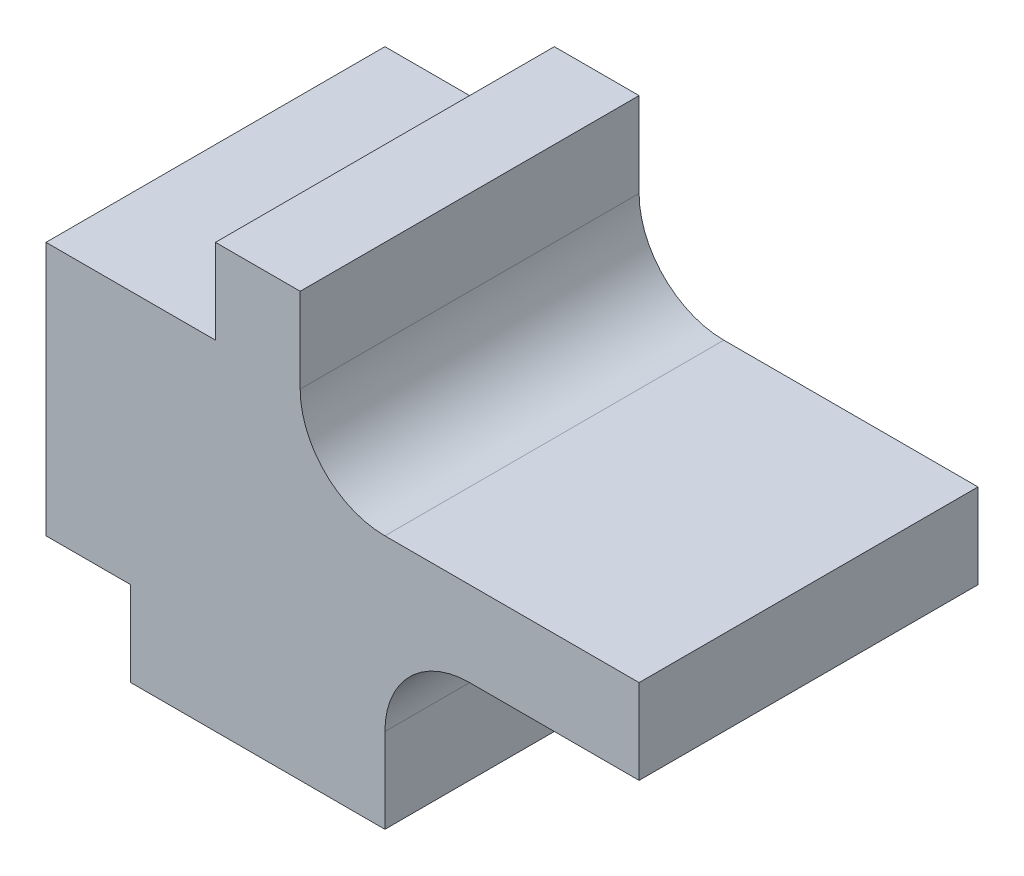
ISO-10303-21;
HEADER;
FILE_DESCRIPTION(('STEP AP214'),'2;1');
FILE_NAME('part.step','',(''),(''),'','','');
FILE_SCHEMA(('AUTOMOTIVE_DESIGN { 1 0 10303 214 1 1 1 1 }'));
ENDSEC;
DATA;
#1=APPLICATION_CONTEXT('core data for automotive mechanical design processes');
#2=APPLICATION_PROTOCOL_DEFINITION('international standard','automotive_design',2000,#1);
#3=PRODUCT_CONTEXT('',#1,'mechanical');
#4=PRODUCT('Part','Part','',(#3));
#5=PRODUCT_RELATED_PRODUCT_CATEGORY('part','',(#4));
#6=PRODUCT_DEFINITION_FORMATION('','',#4);
#7=PRODUCT_DEFINITION_CONTEXT('part definition',#1,'design');
#8=PRODUCT_DEFINITION('design','',#6,#7);
#9=PRODUCT_DEFINITION_SHAPE('','',#8);
#10=(LENGTH_UNIT() NAMED_UNIT(*) SI_UNIT(.MILLI.,.METRE.));
#11=(NAMED_UNIT(*) PLANE_ANGLE_UNIT() SI_UNIT($,.RADIAN.));
#12=(NAMED_UNIT(*) SI_UNIT($,.STERADIAN.) SOLID_ANGLE_UNIT());
#13=UNCERTAINTY_MEASURE_WITH_UNIT(LENGTH_MEASURE(1.E-05),#10,'distance_accuracy_value','');
#14=(GEOMETRIC_REPRESENTATION_CONTEXT(3) GLOBAL_UNCERTAINTY_ASSIGNED_CONTEXT((#13)) GLOBAL_UNIT_ASSIGNED_CONTEXT((#10,
#11,#12)) REPRESENTATION_CONTEXT('',''));
#15=CARTESIAN_POINT('',(0.,0.,0.));
#16=DIRECTION('',(0.,0.,1.));
#17=DIRECTION('',(1.,0.,0.));
#18=AXIS2_PLACEMENT_3D('',#15,#16,#17);
#19=CARTESIAN_POINT('',(0.,5.,20.));
#20=DIRECTION('',(1.,0.,0.));
#21=DIRECTION('',(0.,0.,-1.));
#22=AXIS2_PLACEMENT_3D('',#19,#20,#21);
#23=PLANE('',#22);
#24=DIRECTION('',(0.,-1.,0.));
#25=VECTOR('',#24,1.);
#26=CARTESIAN_POINT('',(0.,5.,0.));
#27=LINE('',#26,#25);
#28=CARTESIAN_POINT('',(0.,5.,0.));
#29=VERTEX_POINT('',#28);
#30=CARTESIAN_POINT('',(0.,0.,0.));
#31=VERTEX_POINT('',#30);
#32=EDGE_CURVE('E165',#29,#31,#27,.T.);
#33=ORIENTED_EDGE('',*,*,#32,.T.);
#34=DIRECTION('',(0.,0.,-1.));
#35=VECTOR('',#34,1.);
#36=CARTESIAN_POINT('',(0.,0.,20.));
#37=LINE('',#36,#35);
#38=CARTESIAN_POINT('',(0.,0.,20.));
#39=VERTEX_POINT('',#38);
#40=EDGE_CURVE('E11',#39,#31,#37,.T.);
#41=ORIENTED_EDGE('',*,*,#40,.F.);
#42=DIRECTION('',(0.,-1.,0.));
#43=VECTOR('',#42,1.);
#44=CARTESIAN_POINT('',(0.,5.,20.));
#45=LINE('',#44,#43);
#46=CARTESIAN_POINT('',(0.,5.,20.));
#47=VERTEX_POINT('',#46);
#48=EDGE_CURVE('E191',#47,#39,#45,.T.);
#49=ORIENTED_EDGE('',*,*,#48,.F.);
#50=DIRECTION('',(0.,0.,-1.));
#51=VECTOR('',#50,1.);
#52=CARTESIAN_POINT('',(0.,5.,20.));
#53=LINE('',#52,#51);
#54=EDGE_CURVE('E161',#47,#29,#53,.T.);
#55=ORIENTED_EDGE('',*,*,#54,.T.);
#56=EDGE_LOOP('',(#33,#41,#49,#55));
#57=FACE_BOUND('',#56,.T.);
#58=ADVANCED_FACE('F33',(#57),#23,.F.);
#59=CARTESIAN_POINT('',(0.,0.,20.));
#60=DIRECTION('',(0.,1.,0.));
#61=DIRECTION('',(0.,0.,1.));
#62=AXIS2_PLACEMENT_3D('',#59,#60,#61);
#63=PLANE('',#62);
#64=DIRECTION('',(1.,0.,0.));
#65=VECTOR('',#64,1.);
#66=CARTESIAN_POINT('',(0.,0.,0.));
#67=LINE('',#66,#65);
#68=CARTESIAN_POINT('',(15.,0.,0.));
#69=VERTEX_POINT('',#68);
#70=EDGE_CURVE('E168',#31,#69,#67,.T.);
#71=ORIENTED_EDGE('',*,*,#70,.T.);
#72=DIRECTION('',(0.,0.,-1.));
#73=VECTOR('',#72,1.);
#74=CARTESIAN_POINT('',(15.,0.,20.));
#75=LINE('',#74,#73);
#76=CARTESIAN_POINT('',(15.,0.,20.));
#77=VERTEX_POINT('',#76);
#78=EDGE_CURVE('E41',#77,#69,#75,.T.);
#79=ORIENTED_EDGE('',*,*,#78,.F.);
#80=DIRECTION('',(1.,0.,0.));
#81=VECTOR('',#80,1.);
#82=CARTESIAN_POINT('',(0.,0.,20.));
#83=LINE('',#82,#81);
#84=EDGE_CURVE('E110',#39,#77,#83,.T.);
#85=ORIENTED_EDGE('',*,*,#84,.F.);
#86=ORIENTED_EDGE('',*,*,#40,.T.);
#87=EDGE_LOOP('',(#71,#79,#85,#86));
#88=FACE_BOUND('',#87,.T.);
#89=ADVANCED_FACE('F279',(#88),#63,.F.);
#90=CARTESIAN_POINT('',(15.,0.,20.));
#91=DIRECTION('',(-1.,0.,0.));
#92=DIRECTION('',(0.,0.,1.));
#93=AXIS2_PLACEMENT_3D('',#90,#91,#92);
#94=PLANE('',#93);
#95=DIRECTION('',(0.,1.,0.));
#96=VECTOR('',#95,1.);
#97=CARTESIAN_POINT('',(15.,0.,0.));
#98=LINE('',#97,#96);
#99=CARTESIAN_POINT('',(15.,4.99999999999997,0.));
#100=VERTEX_POINT('',#99);
#101=EDGE_CURVE('E170',#69,#100,#98,.T.);
#102=ORIENTED_EDGE('',*,*,#101,.T.);
#103=DIRECTION('',(0.,0.,-1.));
#104=VECTOR('',#103,1.);
#105=CARTESIAN_POINT('',(15.,4.99999999999997,20.));
#106=LINE('',#105,#104);
#107=CARTESIAN_POINT('',(15.,4.99999999999997,20.));
#108=VERTEX_POINT('',#107);
#109=EDGE_CURVE('E216',#108,#100,#106,.T.);
#110=ORIENTED_EDGE('',*,*,#109,.F.);
#111=DIRECTION('',(0.,1.,0.));
#112=VECTOR('',#111,1.);
#113=CARTESIAN_POINT('',(15.,0.,20.));
#114=LINE('',#113,#112);
#115=EDGE_CURVE('E224',#77,#108,#114,.T.);
#116=ORIENTED_EDGE('',*,*,#115,.F.);
#117=ORIENTED_EDGE('',*,*,#78,.T.);
#118=EDGE_LOOP('',(#102,#110,#116,#117));
#119=FACE_BOUND('',#118,.T.);
#120=ADVANCED_FACE('F222',(#119),#94,.F.);
#121=CARTESIAN_POINT('',(20.,5.,20.));
#122=DIRECTION('',(0.,0.,-1.));
#123=DIRECTION('',(-1.,0.,0.));
#124=AXIS2_PLACEMENT_3D('',#121,#122,#123);
#125=CYLINDRICAL_SURFACE('',#124,5.);
#126=CARTESIAN_POINT('',(20.,5.,0.));
#127=DIRECTION('',(0.,0.,-1.));
#128=DIRECTION('',(-1.,0.,0.));
#129=AXIS2_PLACEMENT_3D('',#126,#127,#128);
#130=CIRCLE('',#129,5.);
#131=CARTESIAN_POINT('',(20.,10.,0.));
#132=VERTEX_POINT('',#131);
#133=EDGE_CURVE('E172',#100,#132,#130,.T.);
#134=ORIENTED_EDGE('',*,*,#133,.T.);
#135=DIRECTION('',(0.,0.,-1.));
#136=VECTOR('',#135,1.);
#137=CARTESIAN_POINT('',(20.,10.,20.));
#138=LINE('',#137,#136);
#139=CARTESIAN_POINT('',(20.,10.,20.));
#140=VERTEX_POINT('',#139);
#141=EDGE_CURVE('E213',#140,#132,#138,.T.);
#142=ORIENTED_EDGE('',*,*,#141,.F.);
#143=CARTESIAN_POINT('',(20.,5.,20.));
#144=DIRECTION('',(0.,0.,-1.));
#145=DIRECTION('',(-1.,0.,0.));
#146=AXIS2_PLACEMENT_3D('',#143,#144,#145);
#147=CIRCLE('',#146,5.);
#148=EDGE_CURVE('E242',#108,#140,#147,.T.);
#149=ORIENTED_EDGE('',*,*,#148,.F.);
#150=ORIENTED_EDGE('',*,*,#109,.T.);
#151=EDGE_LOOP('',(#134,#142,#149,#150));
#152=FACE_BOUND('',#151,.T.);
#153=ADVANCED_FACE('F233',(#152),#125,.F.);
#154=CARTESIAN_POINT('',(20.,10.,20.));
#155=DIRECTION('',(0.,1.,0.));
#156=DIRECTION('',(-1.,0.,0.));
#157=AXIS2_PLACEMENT_3D('',#154,#155,#156);
#158=PLANE('',#157);
#159=DIRECTION('',(1.,0.,0.));
#160=VECTOR('',#159,1.);
#161=CARTESIAN_POINT('',(20.,10.,0.));
#162=LINE('',#161,#160);
#163=CARTESIAN_POINT('',(30.,10.,0.));
#164=VERTEX_POINT('',#163);
#165=EDGE_CURVE('E174',#132,#164,#162,.T.);
#166=ORIENTED_EDGE('',*,*,#165,.T.);
#167=DIRECTION('',(0.,0.,-1.));
#168=VECTOR('',#167,1.);
#169=CARTESIAN_POINT('',(30.,10.,20.));
#170=LINE('',#169,#168);
#171=CARTESIAN_POINT('',(30.,10.,20.));
#172=VERTEX_POINT('',#171);
#173=EDGE_CURVE('E210',#172,#164,#170,.T.);
#174=ORIENTED_EDGE('',*,*,#173,.F.);
#175=DIRECTION('',(1.,0.,0.));
#176=VECTOR('',#175,1.);
#177=CARTESIAN_POINT('',(20.,10.,20.));
#178=LINE('',#177,#176);
#179=EDGE_CURVE('E239',#140,#172,#178,.T.);
#180=ORIENTED_EDGE('',*,*,#179,.F.);
#181=ORIENTED_EDGE('',*,*,#141,.T.);
#182=EDGE_LOOP('',(#166,#174,#180,#181));
#183=FACE_BOUND('',#182,.T.);
#184=ADVANCED_FACE('F237',(#183),#158,.F.);
#185=CARTESIAN_POINT('',(30.,10.,20.));
#186=DIRECTION('',(-1.,0.,0.));
#187=DIRECTION('',(0.,-1.,0.));
#188=AXIS2_PLACEMENT_3D('',#185,#186,#187);
#189=PLANE('',#188);
#190=DIRECTION('',(0.,1.,0.));
#191=VECTOR('',#190,1.);
#192=CARTESIAN_POINT('',(30.,10.,0.));
#193=LINE('',#192,#191);
#194=CARTESIAN_POINT('',(30.,15.,0.));
#195=VERTEX_POINT('',#194);
#196=EDGE_CURVE('E176',#164,#195,#193,.T.);
#197=ORIENTED_EDGE('',*,*,#196,.T.);
#198=DIRECTION('',(0.,0.,-1.));
#199=VECTOR('',#198,1.);
#200=CARTESIAN_POINT('',(30.,15.,20.));
#201=LINE('',#200,#199);
#202=CARTESIAN_POINT('',(30.,15.,20.));
#203=VERTEX_POINT('',#202);
#204=EDGE_CURVE('E207',#203,#195,#201,.T.);
#205=ORIENTED_EDGE('',*,*,#204,.F.);
#206=DIRECTION('',(0.,1.,0.));
#207=VECTOR('',#206,1.);
#208=CARTESIAN_POINT('',(30.,10.,20.));
#209=LINE('',#208,#207);
#210=EDGE_CURVE('E241',#172,#203,#209,.T.);
#211=ORIENTED_EDGE('',*,*,#210,.F.);
#212=ORIENTED_EDGE('',*,*,#173,.T.);
#213=EDGE_LOOP('',(#197,#205,#211,#212));
#214=FACE_BOUND('',#213,.T.);
#215=ADVANCED_FACE('F292',(#214),#189,.F.);
#216=CARTESIAN_POINT('',(30.,15.,20.));
#217=DIRECTION('',(0.,-1.,0.));
#218=DIRECTION('',(1.,0.,0.));
#219=AXIS2_PLACEMENT_3D('',#216,#217,#218);
#220=PLANE('',#219);
#221=DIRECTION('',(-1.,0.,0.));
#222=VECTOR('',#221,1.);
#223=CARTESIAN_POINT('',(30.,15.,0.));
#224=LINE('',#223,#222);
#225=CARTESIAN_POINT('',(15.,15.,0.));
#226=VERTEX_POINT('',#225);
#227=EDGE_CURVE('E178',#195,#226,#224,.T.);
#228=ORIENTED_EDGE('',*,*,#227,.T.);
#229=DIRECTION('',(0.,0.,-1.));
#230=VECTOR('',#229,1.);
#231=CARTESIAN_POINT('',(15.,15.,20.));
#232=LINE('',#231,#230);
#233=CARTESIAN_POINT('',(15.,15.,20.));
#234=VERTEX_POINT('',#233);
#235=EDGE_CURVE('E204',#234,#226,#232,.T.);
#236=ORIENTED_EDGE('',*,*,#235,.F.);
#237=DIRECTION('',(-1.,0.,0.));
#238=VECTOR('',#237,1.);
#239=CARTESIAN_POINT('',(30.,15.,20.));
#240=LINE('',#239,#238);
#241=EDGE_CURVE('E244',#203,#234,#240,.T.);
#242=ORIENTED_EDGE('',*,*,#241,.F.);
#243=ORIENTED_EDGE('',*,*,#204,.T.);
#244=EDGE_LOOP('',(#228,#236,#242,#243));
#245=FACE_BOUND('',#244,.T.);
#246=ADVANCED_FACE('F295',(#245),#220,.F.);
#247=CARTESIAN_POINT('',(15.,20.,20.));
#248=DIRECTION('',(0.,0.,-1.));
#249=DIRECTION('',(-1.,0.,0.));
#250=AXIS2_PLACEMENT_3D('',#247,#248,#249);
#251=CYLINDRICAL_SURFACE('',#250,5.);
#252=CARTESIAN_POINT('',(15.,20.,0.));
#253=DIRECTION('',(0.,0.,-1.));
#254=DIRECTION('',(-1.,0.,0.));
#255=AXIS2_PLACEMENT_3D('',#252,#253,#254);
#256=CIRCLE('',#255,5.);
#257=CARTESIAN_POINT('',(9.99999999999999,20.,0.));
#258=VERTEX_POINT('',#257);
#259=EDGE_CURVE('E180',#226,#258,#256,.T.);
#260=ORIENTED_EDGE('',*,*,#259,.T.);
#261=DIRECTION('',(0.,0.,-1.));
#262=VECTOR('',#261,1.);
#263=CARTESIAN_POINT('',(9.99999999999999,20.,20.));
#264=LINE('',#263,#262);
#265=CARTESIAN_POINT('',(9.99999999999999,20.,20.));
#266=VERTEX_POINT('',#265);
#267=EDGE_CURVE('E201',#266,#258,#264,.T.);
#268=ORIENTED_EDGE('',*,*,#267,.F.);
#269=CARTESIAN_POINT('',(15.,20.,20.));
#270=DIRECTION('',(0.,0.,-1.));
#271=DIRECTION('',(-1.,0.,0.));
#272=AXIS2_PLACEMENT_3D('',#269,#270,#271);
#273=CIRCLE('',#272,5.);
#274=EDGE_CURVE('E250',#234,#266,#273,.T.);
#275=ORIENTED_EDGE('',*,*,#274,.F.);
#276=ORIENTED_EDGE('',*,*,#235,.T.);
#277=EDGE_LOOP('',(#260,#268,#275,#276));
#278=FACE_BOUND('',#277,.T.);
#279=ADVANCED_FACE('F299',(#278),#251,.F.);
#280=CARTESIAN_POINT('',(9.99999999999999,20.,20.));
#281=DIRECTION('',(-1.,0.,0.));
#282=DIRECTION('',(0.,0.,1.));
#283=AXIS2_PLACEMENT_3D('',#280,#281,#282);
#284=PLANE('',#283);
#285=DIRECTION('',(0.,1.,0.));
#286=VECTOR('',#285,1.);
#287=CARTESIAN_POINT('',(9.99999999999999,20.,0.));
#288=LINE('',#287,#286);
#289=CARTESIAN_POINT('',(9.99999999999999,25.,0.));
#290=VERTEX_POINT('',#289);
#291=EDGE_CURVE('E182',#258,#290,#288,.T.);
#292=ORIENTED_EDGE('',*,*,#291,.T.);
#293=DIRECTION('',(0.,0.,-1.));
#294=VECTOR('',#293,1.);
#295=CARTESIAN_POINT('',(9.99999999999999,25.,20.));
#296=LINE('',#295,#294);
#297=CARTESIAN_POINT('',(9.99999999999999,25.,20.));
#298=VERTEX_POINT('',#297);
#299=EDGE_CURVE('E198',#298,#290,#296,.T.);
#300=ORIENTED_EDGE('',*,*,#299,.F.);
#301=DIRECTION('',(0.,1.,0.));
#302=VECTOR('',#301,1.);
#303=CARTESIAN_POINT('',(9.99999999999999,20.,20.));
#304=LINE('',#303,#302);
#305=EDGE_CURVE('E252',#266,#298,#304,.T.);
#306=ORIENTED_EDGE('',*,*,#305,.F.);
#307=ORIENTED_EDGE('',*,*,#267,.T.);
#308=EDGE_LOOP('',(#292,#300,#306,#307));
#309=FACE_BOUND('',#308,.T.);
#310=ADVANCED_FACE('F303',(#309),#284,.F.);
#311=CARTESIAN_POINT('',(9.99999999999999,25.,20.));
#312=DIRECTION('',(0.,-1.,0.));
#313=DIRECTION('',(1.,0.,0.));
#314=AXIS2_PLACEMENT_3D('',#311,#312,#313);
#315=PLANE('',#314);
#316=DIRECTION('',(-1.,0.,0.));
#317=VECTOR('',#316,1.);
#318=CARTESIAN_POINT('',(9.99999999999999,25.,0.));
#319=LINE('',#318,#317);
#320=CARTESIAN_POINT('',(4.99999999999999,25.,0.));
#321=VERTEX_POINT('',#320);
#322=EDGE_CURVE('E184',#290,#321,#319,.T.);
#323=ORIENTED_EDGE('',*,*,#322,.T.);
#324=DIRECTION('',(0.,0.,-1.));
#325=VECTOR('',#324,1.);
#326=CARTESIAN_POINT('',(4.99999999999999,25.,20.));
#327=LINE('',#326,#325);
#328=CARTESIAN_POINT('',(4.99999999999999,25.,20.));
#329=VERTEX_POINT('',#328);
#330=EDGE_CURVE('E195',#329,#321,#327,.T.);
#331=ORIENTED_EDGE('',*,*,#330,.F.);
#332=DIRECTION('',(-1.,0.,0.));
#333=VECTOR('',#332,1.);
#334=CARTESIAN_POINT('',(9.99999999999999,25.,20.));
#335=LINE('',#334,#333);
#336=EDGE_CURVE('E254',#298,#329,#335,.T.);
#337=ORIENTED_EDGE('',*,*,#336,.F.);
#338=ORIENTED_EDGE('',*,*,#299,.T.);
#339=EDGE_LOOP('',(#323,#331,#337,#338));
#340=FACE_BOUND('',#339,.T.);
#341=ADVANCED_FACE('F260',(#340),#315,.F.);
#342=CARTESIAN_POINT('',(4.99999999999999,25.,20.));
#343=DIRECTION('',(1.,0.,0.));
#344=DIRECTION('',(0.,1.,0.));
#345=AXIS2_PLACEMENT_3D('',#342,#343,#344);
#346=PLANE('',#345);
#347=DIRECTION('',(0.,-1.,0.));
#348=VECTOR('',#347,1.);
#349=CARTESIAN_POINT('',(4.99999999999999,25.,0.));
#350=LINE('',#349,#348);
#351=CARTESIAN_POINT('',(5.,20.,0.));
#352=VERTEX_POINT('',#351);
#353=EDGE_CURVE('E186',#321,#352,#350,.T.);
#354=ORIENTED_EDGE('',*,*,#353,.T.);
#355=DIRECTION('',(0.,0.,-1.));
#356=VECTOR('',#355,1.);
#357=CARTESIAN_POINT('',(5.,20.,20.));
#358=LINE('',#357,#356);
#359=CARTESIAN_POINT('',(5.,20.,20.));
#360=VERTEX_POINT('',#359);
#361=EDGE_CURVE('E156',#360,#352,#358,.T.);
#362=ORIENTED_EDGE('',*,*,#361,.F.);
#363=DIRECTION('',(0.,-1.,0.));
#364=VECTOR('',#363,1.);
#365=CARTESIAN_POINT('',(4.99999999999999,25.,20.));
#366=LINE('',#365,#364);
#367=EDGE_CURVE('E147',#329,#360,#366,.T.);
#368=ORIENTED_EDGE('',*,*,#367,.F.);
#369=ORIENTED_EDGE('',*,*,#330,.T.);
#370=EDGE_LOOP('',(#354,#362,#368,#369));
#371=FACE_BOUND('',#370,.T.);
#372=ADVANCED_FACE('F264',(#371),#346,.F.);
#373=CARTESIAN_POINT('',(5.,20.,20.));
#374=DIRECTION('',(0.,-1.,0.));
#375=DIRECTION('',(0.,0.,-1.));
#376=AXIS2_PLACEMENT_3D('',#373,#374,#375);
#377=PLANE('',#376);
#378=DIRECTION('',(-1.,0.,0.));
#379=VECTOR('',#378,1.);
#380=CARTESIAN_POINT('',(5.,20.,0.));
#381=LINE('',#380,#379);
#382=CARTESIAN_POINT('',(-5.,20.,0.));
#383=VERTEX_POINT('',#382);
#384=EDGE_CURVE('E155',#352,#383,#381,.T.);
#385=ORIENTED_EDGE('',*,*,#384,.T.);
#386=DIRECTION('',(0.,0.,-1.));
#387=VECTOR('',#386,1.);
#388=CARTESIAN_POINT('',(-5.,20.,20.));
#389=LINE('',#388,#387);
#390=CARTESIAN_POINT('',(-5.,20.,20.));
#391=VERTEX_POINT('',#390);
#392=EDGE_CURVE('E152',#391,#383,#389,.T.);
#393=ORIENTED_EDGE('',*,*,#392,.F.);
#394=DIRECTION('',(-1.,0.,0.));
#395=VECTOR('',#394,1.);
#396=CARTESIAN_POINT('',(5.,20.,20.));
#397=LINE('',#396,#395);
#398=EDGE_CURVE('E141',#360,#391,#397,.T.);
#399=ORIENTED_EDGE('',*,*,#398,.F.);
#400=ORIENTED_EDGE('',*,*,#361,.T.);
#401=EDGE_LOOP('',(#385,#393,#399,#400));
#402=FACE_BOUND('',#401,.T.);
#403=ADVANCED_FACE('F153',(#402),#377,.F.);
#404=CARTESIAN_POINT('',(-5.,20.,20.));
#405=DIRECTION('',(1.,0.,0.));
#406=DIRECTION('',(0.,1.,0.));
#407=AXIS2_PLACEMENT_3D('',#404,#405,#406);
#408=PLANE('',#407);
#409=DIRECTION('',(0.,-1.,0.));
#410=VECTOR('',#409,1.);
#411=CARTESIAN_POINT('',(-5.,20.,0.));
#412=LINE('',#411,#410);
#413=CARTESIAN_POINT('',(-5.,5.,0.));
#414=VERTEX_POINT('',#413);
#415=EDGE_CURVE('E96',#383,#414,#412,.T.);
#416=ORIENTED_EDGE('',*,*,#415,.T.);
#417=DIRECTION('',(0.,0.,-1.));
#418=VECTOR('',#417,1.);
#419=CARTESIAN_POINT('',(-5.,5.,20.));
#420=LINE('',#419,#418);
#421=CARTESIAN_POINT('',(-5.,5.,20.));
#422=VERTEX_POINT('',#421);
#423=EDGE_CURVE('E157',#422,#414,#420,.T.);
#424=ORIENTED_EDGE('',*,*,#423,.F.);
#425=DIRECTION('',(0.,-1.,0.));
#426=VECTOR('',#425,1.);
#427=CARTESIAN_POINT('',(-5.,20.,20.));
#428=LINE('',#427,#426);
#429=EDGE_CURVE('E145',#391,#422,#428,.T.);
#430=ORIENTED_EDGE('',*,*,#429,.F.);
#431=ORIENTED_EDGE('',*,*,#392,.T.);
#432=EDGE_LOOP('',(#416,#424,#430,#431));
#433=FACE_BOUND('',#432,.T.);
#434=ADVANCED_FACE('F159',(#433),#408,.F.);
#435=CARTESIAN_POINT('',(-5.,5.,20.));
#436=DIRECTION('',(0.,1.,0.));
#437=DIRECTION('',(0.,0.,1.));
#438=AXIS2_PLACEMENT_3D('',#435,#436,#437);
#439=PLANE('',#438);
#440=DIRECTION('',(1.,0.,0.));
#441=VECTOR('',#440,1.);
#442=CARTESIAN_POINT('',(-5.,5.,0.));
#443=LINE('',#442,#441);
#444=EDGE_CURVE('E102',#414,#29,#443,.T.);
#445=ORIENTED_EDGE('',*,*,#444,.T.);
#446=ORIENTED_EDGE('',*,*,#54,.F.);
#447=DIRECTION('',(1.,0.,0.));
#448=VECTOR('',#447,1.);
#449=CARTESIAN_POINT('',(-5.,5.,20.));
#450=LINE('',#449,#448);
#451=EDGE_CURVE('E49',#422,#47,#450,.T.);
#452=ORIENTED_EDGE('',*,*,#451,.F.);
#453=ORIENTED_EDGE('',*,*,#423,.T.);
#454=EDGE_LOOP('',(#445,#446,#452,#453));
#455=FACE_BOUND('',#454,.T.);
#456=ADVANCED_FACE('F268',(#455),#439,.F.);
#457=CARTESIAN_POINT('',(20.,5.,20.));
#458=DIRECTION('',(0.,0.,-1.));
#459=DIRECTION('',(-1.,0.,0.));
#460=AXIS2_PLACEMENT_3D('',#457,#458,#459);
#461=PLANE('',#460);
#462=ORIENTED_EDGE('',*,*,#48,.T.);
#463=ORIENTED_EDGE('',*,*,#84,.T.);
#464=ORIENTED_EDGE('',*,*,#115,.T.);
#465=ORIENTED_EDGE('',*,*,#148,.T.);
#466=ORIENTED_EDGE('',*,*,#179,.T.);
#467=ORIENTED_EDGE('',*,*,#210,.T.);
#468=ORIENTED_EDGE('',*,*,#241,.T.);
#469=ORIENTED_EDGE('',*,*,#274,.T.);
#470=ORIENTED_EDGE('',*,*,#305,.T.);
#471=ORIENTED_EDGE('',*,*,#336,.T.);
#472=ORIENTED_EDGE('',*,*,#367,.T.);
#473=ORIENTED_EDGE('',*,*,#398,.T.);
#474=ORIENTED_EDGE('',*,*,#429,.T.);
#475=ORIENTED_EDGE('',*,*,#451,.T.);
#476=EDGE_LOOP('',(#462,#463,#464,#465,#466,#467,#468,#469,#470,#471,#472,#473,#474,#475));
#477=FACE_BOUND('',#476,.T.);
#478=ADVANCED_FACE('F143',(#477),#461,.F.);
#479=CARTESIAN_POINT('',(20.,5.,0.));
#480=DIRECTION('',(0.,0.,-1.));
#481=DIRECTION('',(-1.,0.,0.));
#482=AXIS2_PLACEMENT_3D('',#479,#480,#481);
#483=PLANE('',#482);
#484=ORIENTED_EDGE('',*,*,#32,.F.);
#485=ORIENTED_EDGE('',*,*,#444,.F.);
#486=ORIENTED_EDGE('',*,*,#415,.F.);
#487=ORIENTED_EDGE('',*,*,#384,.F.);
#488=ORIENTED_EDGE('',*,*,#353,.F.);
#489=ORIENTED_EDGE('',*,*,#322,.F.);
#490=ORIENTED_EDGE('',*,*,#291,.F.);
#491=ORIENTED_EDGE('',*,*,#259,.F.);
#492=ORIENTED_EDGE('',*,*,#227,.F.);
#493=ORIENTED_EDGE('',*,*,#196,.F.);
#494=ORIENTED_EDGE('',*,*,#165,.F.);
#495=ORIENTED_EDGE('',*,*,#133,.F.);
#496=ORIENTED_EDGE('',*,*,#101,.F.);
#497=ORIENTED_EDGE('',*,*,#70,.F.);
#498=EDGE_LOOP('',(#484,#485,#486,#487,#488,#489,#490,#491,#492,#493,#494,#495,#496,#497));
#499=FACE_BOUND('',#498,.T.);
#500=ADVANCED_FACE('F228',(#499),#483,.T.);
#501=CLOSED_SHELL('',(#58,#89,#120,#153,#184,#215,#246,#279,#310,#341,#372,#403,#434,#456,#478,#500));
#502=MANIFOLD_SOLID_BREP('B2',#501);
#503=ADVANCED_BREP_SHAPE_REPRESENTATION('',(#18,#502),#14);
#504=SHAPE_DEFINITION_REPRESENTATION(#9,#503);
ENDSEC;
END-ISO-10303-21;
